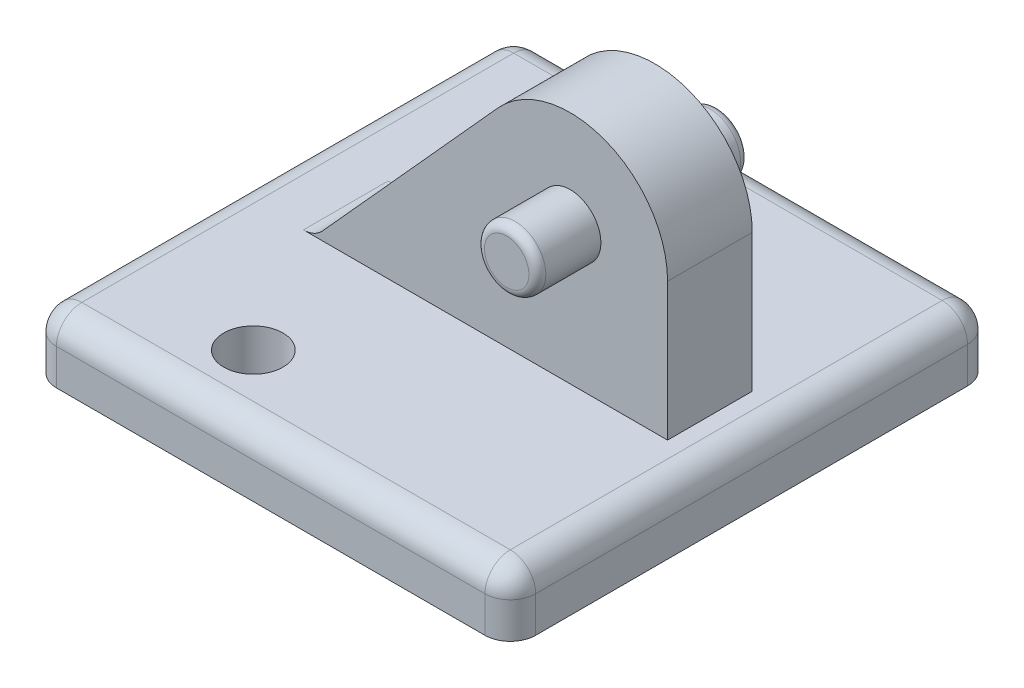
ISO-10303-21;
HEADER;
FILE_DESCRIPTION(('STEP AP214'),'2;1');
FILE_NAME('part.step','',(''),(''),'','','');
FILE_SCHEMA(('AUTOMOTIVE_DESIGN { 1 0 10303 214 1 1 1 1 }'));
ENDSEC;
DATA;
#1=APPLICATION_CONTEXT('core data for automotive mechanical design processes');
#2=APPLICATION_PROTOCOL_DEFINITION('international standard','automotive_design',2000,#1);
#3=PRODUCT_CONTEXT('',#1,'mechanical');
#4=PRODUCT('Part','Part','',(#3));
#5=PRODUCT_RELATED_PRODUCT_CATEGORY('part','',(#4));
#6=PRODUCT_DEFINITION_FORMATION('','',#4);
#7=PRODUCT_DEFINITION_CONTEXT('part definition',#1,'design');
#8=PRODUCT_DEFINITION('design','',#6,#7);
#9=PRODUCT_DEFINITION_SHAPE('','',#8);
#10=(LENGTH_UNIT() NAMED_UNIT(*) SI_UNIT(.MILLI.,.METRE.));
#11=(NAMED_UNIT(*) PLANE_ANGLE_UNIT() SI_UNIT($,.RADIAN.));
#12=(NAMED_UNIT(*) SI_UNIT($,.STERADIAN.) SOLID_ANGLE_UNIT());
#13=UNCERTAINTY_MEASURE_WITH_UNIT(LENGTH_MEASURE(1.E-05),#10,'distance_accuracy_value','');
#14=(GEOMETRIC_REPRESENTATION_CONTEXT(3) GLOBAL_UNCERTAINTY_ASSIGNED_CONTEXT((#13)) GLOBAL_UNIT_ASSIGNED_CONTEXT((#10,
#11,#12)) REPRESENTATION_CONTEXT('',''));
#15=CARTESIAN_POINT('',(0.,0.,0.));
#16=DIRECTION('',(0.,0.,1.));
#17=DIRECTION('',(1.,0.,0.));
#18=AXIS2_PLACEMENT_3D('',#15,#16,#17);
#19=CARTESIAN_POINT('',(0.,1.8415,0.));
#20=DIRECTION('',(0.,1.,0.));
#21=DIRECTION('',(0.,0.,1.));
#22=AXIS2_PLACEMENT_3D('',#19,#20,#21);
#23=PLANE('',#22);
#24=DIRECTION('',(1.,0.,0.));
#25=VECTOR('',#24,1.);
#26=CARTESIAN_POINT('',(7.1882,1.8415,6.477));
#27=LINE('',#26,#25);
#28=CARTESIAN_POINT('',(-6.4262,1.8415,6.477));
#29=VERTEX_POINT('',#28);
#30=CARTESIAN_POINT('',(6.4262,1.8415,6.477));
#31=VERTEX_POINT('',#30);
#32=EDGE_CURVE('E243',#29,#31,#27,.T.);
#33=ORIENTED_EDGE('',*,*,#32,.T.);
#34=DIRECTION('',(0.,0.,-1.));
#35=VECTOR('',#34,1.);
#36=CARTESIAN_POINT('',(6.4262,1.8415,-7.239));
#37=LINE('',#36,#35);
#38=CARTESIAN_POINT('',(6.4262,1.8415,-6.477));
#39=VERTEX_POINT('',#38);
#40=EDGE_CURVE('E249',#31,#39,#37,.T.);
#41=ORIENTED_EDGE('',*,*,#40,.T.);
#42=DIRECTION('',(-1.,0.,0.));
#43=VECTOR('',#42,1.);
#44=CARTESIAN_POINT('',(-7.1882,1.8415,-6.477));
#45=LINE('',#44,#43);
#46=CARTESIAN_POINT('',(-6.4262,1.8415,-6.477));
#47=VERTEX_POINT('',#46);
#48=EDGE_CURVE('E246',#39,#47,#45,.T.);
#49=ORIENTED_EDGE('',*,*,#48,.T.);
#50=DIRECTION('',(0.,0.,1.));
#51=VECTOR('',#50,1.);
#52=CARTESIAN_POINT('',(-6.4262,1.8415,7.239));
#53=LINE('',#52,#51);
#54=EDGE_CURVE('E240',#47,#29,#53,.T.);
#55=ORIENTED_EDGE('',*,*,#54,.T.);
#56=EDGE_LOOP('',(#33,#41,#49,#55));
#57=FACE_BOUND('',#56,.T.);
#58=DIRECTION('',(0.,0.,-1.));
#59=VECTOR('',#58,1.);
#60=CARTESIAN_POINT('',(-4.98675839684199,1.8415,-1.27));
#61=LINE('',#60,#59);
#62=CARTESIAN_POINT('',(-4.98675839684199,1.8415,1.27));
#63=VERTEX_POINT('',#62);
#64=CARTESIAN_POINT('',(-4.98675839684199,1.8415,-1.27));
#65=VERTEX_POINT('',#64);
#66=EDGE_CURVE('E236',#63,#65,#61,.T.);
#67=ORIENTED_EDGE('',*,*,#66,.T.);
#68=DIRECTION('',(1.,0.,0.));
#69=VECTOR('',#68,1.);
#70=CARTESIAN_POINT('',(0.,1.8415,-1.27));
#71=LINE('',#70,#69);
#72=CARTESIAN_POINT('',(5.93687294963796,1.8415,-1.27));
#73=VERTEX_POINT('',#72);
#74=EDGE_CURVE('E178',#65,#73,#71,.T.);
#75=ORIENTED_EDGE('',*,*,#74,.T.);
#76=DIRECTION('',(0.,0.,-1.));
#77=VECTOR('',#76,1.);
#78=CARTESIAN_POINT('',(5.93687294963796,1.8415,1.27));
#79=LINE('',#78,#77);
#80=CARTESIAN_POINT('',(5.93687294963796,1.8415,1.27));
#81=VERTEX_POINT('',#80);
#82=EDGE_CURVE('E168',#81,#73,#79,.T.);
#83=ORIENTED_EDGE('',*,*,#82,.F.);
#84=DIRECTION('',(1.,0.,0.));
#85=VECTOR('',#84,1.);
#86=CARTESIAN_POINT('',(0.,1.8415,1.27));
#87=LINE('',#86,#85);
#88=EDGE_CURVE('E157',#63,#81,#87,.T.);
#89=ORIENTED_EDGE('',*,*,#88,.F.);
#90=EDGE_LOOP('',(#67,#75,#83,#89));
#91=FACE_BOUND('',#90,.T.);
#92=CARTESIAN_POINT('',(-2.6162,1.8415,-5.1435));
#93=DIRECTION('',(0.,1.,0.));
#94=DIRECTION('',(0.,0.,1.));
#95=AXIS2_PLACEMENT_3D('',#92,#93,#94);
#96=CIRCLE('',#95,0.889);
#97=CARTESIAN_POINT('',(-2.6162,1.8415,-4.2545));
#98=VERTEX_POINT('',#97);
#99=EDGE_CURVE('E213',#98,#98,#96,.T.);
#100=ORIENTED_EDGE('',*,*,#99,.F.);
#101=EDGE_LOOP('',(#100));
#102=FACE_BOUND('',#101,.T.);
#103=CARTESIAN_POINT('',(-2.6162,1.8415,5.1435));
#104=DIRECTION('',(0.,1.,0.));
#105=DIRECTION('',(0.,0.,1.));
#106=AXIS2_PLACEMENT_3D('',#103,#104,#105);
#107=CIRCLE('',#106,0.889);
#108=CARTESIAN_POINT('',(-2.6162,1.8415,6.0325));
#109=VERTEX_POINT('',#108);
#110=EDGE_CURVE('E205',#109,#109,#107,.T.);
#111=ORIENTED_EDGE('',*,*,#110,.F.);
#112=EDGE_LOOP('',(#111));
#113=FACE_BOUND('',#112,.T.);
#114=ADVANCED_FACE('F41',(#57,#91,#102,#113),#23,.T.);
#115=CARTESIAN_POINT('',(0.,0.,0.));
#116=DIRECTION('',(0.,1.,0.));
#117=DIRECTION('',(0.,0.,1.));
#118=AXIS2_PLACEMENT_3D('',#115,#116,#117);
#119=PLANE('',#118);
#120=DIRECTION('',(-1.,0.,0.));
#121=VECTOR('',#120,1.);
#122=CARTESIAN_POINT('',(-7.1882,0.,-7.239));
#123=LINE('',#122,#121);
#124=CARTESIAN_POINT('',(6.4262,0.,-7.239));
#125=VERTEX_POINT('',#124);
#126=CARTESIAN_POINT('',(-6.4262,0.,-7.239));
#127=VERTEX_POINT('',#126);
#128=EDGE_CURVE('E232',#125,#127,#123,.T.);
#129=ORIENTED_EDGE('',*,*,#128,.F.);
#130=CARTESIAN_POINT('',(6.4262,0.,-6.477));
#131=DIRECTION('',(0.,1.,0.));
#132=DIRECTION('',(0.,0.,1.));
#133=AXIS2_PLACEMENT_3D('',#130,#131,#132);
#134=CIRCLE('',#133,0.762);
#135=CARTESIAN_POINT('',(7.1882,0.,-6.477));
#136=VERTEX_POINT('',#135);
#137=EDGE_CURVE('E299',#125,#136,#134,.F.);
#138=ORIENTED_EDGE('',*,*,#137,.T.);
#139=DIRECTION('',(0.,0.,-1.));
#140=VECTOR('',#139,1.);
#141=CARTESIAN_POINT('',(7.1882,0.,-7.239));
#142=LINE('',#141,#140);
#143=CARTESIAN_POINT('',(7.1882,0.,6.477));
#144=VERTEX_POINT('',#143);
#145=EDGE_CURVE('E228',#144,#136,#142,.T.);
#146=ORIENTED_EDGE('',*,*,#145,.F.);
#147=CARTESIAN_POINT('',(6.4262,0.,6.477));
#148=DIRECTION('',(0.,1.,0.));
#149=DIRECTION('',(0.,0.,1.));
#150=AXIS2_PLACEMENT_3D('',#147,#148,#149);
#151=CIRCLE('',#150,0.762);
#152=CARTESIAN_POINT('',(6.4262,0.,7.239));
#153=VERTEX_POINT('',#152);
#154=EDGE_CURVE('E293',#144,#153,#151,.F.);
#155=ORIENTED_EDGE('',*,*,#154,.T.);
#156=DIRECTION('',(1.,0.,0.));
#157=VECTOR('',#156,1.);
#158=CARTESIAN_POINT('',(-7.1882,0.,7.239));
#159=LINE('',#158,#157);
#160=CARTESIAN_POINT('',(-6.4262,0.,7.239));
#161=VERTEX_POINT('',#160);
#162=EDGE_CURVE('E224',#161,#153,#159,.T.);
#163=ORIENTED_EDGE('',*,*,#162,.F.);
#164=CARTESIAN_POINT('',(-6.4262,0.,6.477));
#165=DIRECTION('',(0.,1.,0.));
#166=DIRECTION('',(0.,0.,1.));
#167=AXIS2_PLACEMENT_3D('',#164,#165,#166);
#168=CIRCLE('',#167,0.762);
#169=CARTESIAN_POINT('',(-7.1882,0.,6.477));
#170=VERTEX_POINT('',#169);
#171=EDGE_CURVE('E290',#161,#170,#168,.F.);
#172=ORIENTED_EDGE('',*,*,#171,.T.);
#173=DIRECTION('',(0.,0.,1.));
#174=VECTOR('',#173,1.);
#175=CARTESIAN_POINT('',(-7.1882,0.,-7.239));
#176=LINE('',#175,#174);
#177=CARTESIAN_POINT('',(-7.1882,0.,-6.477));
#178=VERTEX_POINT('',#177);
#179=EDGE_CURVE('E217',#178,#170,#176,.T.);
#180=ORIENTED_EDGE('',*,*,#179,.F.);
#181=CARTESIAN_POINT('',(-6.4262,0.,-6.477));
#182=DIRECTION('',(0.,1.,0.));
#183=DIRECTION('',(0.,0.,1.));
#184=AXIS2_PLACEMENT_3D('',#181,#182,#183);
#185=CIRCLE('',#184,0.762);
#186=EDGE_CURVE('E296',#178,#127,#185,.F.);
#187=ORIENTED_EDGE('',*,*,#186,.T.);
#188=EDGE_LOOP('',(#129,#138,#146,#155,#163,#172,#180,#187));
#189=FACE_BOUND('',#188,.T.);
#190=CARTESIAN_POINT('',(-2.6162,0.,-5.1435));
#191=DIRECTION('',(0.,1.,0.));
#192=DIRECTION('',(0.,0.,1.));
#193=AXIS2_PLACEMENT_3D('',#190,#191,#192);
#194=CIRCLE('',#193,0.889);
#195=CARTESIAN_POINT('',(-2.6162,0.,-4.2545));
#196=VERTEX_POINT('',#195);
#197=EDGE_CURVE('E209',#196,#196,#194,.T.);
#198=ORIENTED_EDGE('',*,*,#197,.T.);
#199=EDGE_LOOP('',(#198));
#200=FACE_BOUND('',#199,.T.);
#201=CARTESIAN_POINT('',(-2.6162,0.,5.1435));
#202=DIRECTION('',(0.,1.,0.));
#203=DIRECTION('',(0.,0.,1.));
#204=AXIS2_PLACEMENT_3D('',#201,#202,#203);
#205=CIRCLE('',#204,0.889);
#206=CARTESIAN_POINT('',(-2.6162,0.,6.0325));
#207=VERTEX_POINT('',#206);
#208=EDGE_CURVE('E167',#207,#207,#205,.T.);
#209=ORIENTED_EDGE('',*,*,#208,.T.);
#210=EDGE_LOOP('',(#209));
#211=FACE_BOUND('',#210,.T.);
#212=ADVANCED_FACE('F378',(#189,#200,#211),#119,.F.);
#213=CARTESIAN_POINT('',(-7.1882,1.8415,-7.239));
#214=DIRECTION('',(1.,0.,0.));
#215=DIRECTION('',(0.,0.,-1.));
#216=AXIS2_PLACEMENT_3D('',#213,#214,#215);
#217=PLANE('',#216);
#218=DIRECTION('',(0.,0.,1.));
#219=VECTOR('',#218,1.);
#220=CARTESIAN_POINT('',(-7.1882,1.0795,-7.239));
#221=LINE('',#220,#219);
#222=CARTESIAN_POINT('',(-7.1882,1.0795,6.477));
#223=VERTEX_POINT('',#222);
#224=CARTESIAN_POINT('',(-7.1882,1.0795,-6.477));
#225=VERTEX_POINT('',#224);
#226=EDGE_CURVE('E284',#223,#225,#221,.F.);
#227=ORIENTED_EDGE('',*,*,#226,.T.);
#228=DIRECTION('',(0.,-1.,0.));
#229=VECTOR('',#228,1.);
#230=CARTESIAN_POINT('',(-7.1882,1.8415,-6.477));
#231=LINE('',#230,#229);
#232=EDGE_CURVE('E287',#225,#178,#231,.T.);
#233=ORIENTED_EDGE('',*,*,#232,.T.);
#234=ORIENTED_EDGE('',*,*,#179,.T.);
#235=DIRECTION('',(0.,-1.,0.));
#236=VECTOR('',#235,1.);
#237=CARTESIAN_POINT('',(-7.1882,1.8415,6.477));
#238=LINE('',#237,#236);
#239=EDGE_CURVE('E281',#170,#223,#238,.F.);
#240=ORIENTED_EDGE('',*,*,#239,.T.);
#241=EDGE_LOOP('',(#227,#233,#234,#240));
#242=FACE_BOUND('',#241,.T.);
#243=ADVANCED_FACE('F384',(#242),#217,.F.);
#244=CARTESIAN_POINT('',(-7.1882,1.8415,7.239));
#245=DIRECTION('',(0.,0.,-1.));
#246=DIRECTION('',(-1.,0.,0.));
#247=AXIS2_PLACEMENT_3D('',#244,#245,#246);
#248=PLANE('',#247);
#249=ORIENTED_EDGE('',*,*,#162,.T.);
#250=DIRECTION('',(0.,-1.,0.));
#251=VECTOR('',#250,1.);
#252=CARTESIAN_POINT('',(6.4262,1.8415,7.239));
#253=LINE('',#252,#251);
#254=CARTESIAN_POINT('',(6.4262,1.0795,7.239));
#255=VERTEX_POINT('',#254);
#256=EDGE_CURVE('E278',#153,#255,#253,.F.);
#257=ORIENTED_EDGE('',*,*,#256,.T.);
#258=DIRECTION('',(1.,0.,0.));
#259=VECTOR('',#258,1.);
#260=CARTESIAN_POINT('',(-7.1882,1.0795,7.239));
#261=LINE('',#260,#259);
#262=CARTESIAN_POINT('',(-6.4262,1.0795,7.239));
#263=VERTEX_POINT('',#262);
#264=EDGE_CURVE('E275',#255,#263,#261,.F.);
#265=ORIENTED_EDGE('',*,*,#264,.T.);
#266=DIRECTION('',(0.,-1.,0.));
#267=VECTOR('',#266,1.);
#268=CARTESIAN_POINT('',(-6.4262,1.8415,7.239));
#269=LINE('',#268,#267);
#270=EDGE_CURVE('E272',#263,#161,#269,.T.);
#271=ORIENTED_EDGE('',*,*,#270,.T.);
#272=EDGE_LOOP('',(#249,#257,#265,#271));
#273=FACE_BOUND('',#272,.T.);
#274=ADVANCED_FACE('F399',(#273),#248,.F.);
#275=CARTESIAN_POINT('',(7.1882,1.8415,-7.239));
#276=DIRECTION('',(-1.,0.,0.));
#277=DIRECTION('',(0.,0.,1.));
#278=AXIS2_PLACEMENT_3D('',#275,#276,#277);
#279=PLANE('',#278);
#280=ORIENTED_EDGE('',*,*,#145,.T.);
#281=DIRECTION('',(0.,-1.,0.));
#282=VECTOR('',#281,1.);
#283=CARTESIAN_POINT('',(7.1882,1.8415,-6.477));
#284=LINE('',#283,#282);
#285=CARTESIAN_POINT('',(7.1882,1.0795,-6.477));
#286=VERTEX_POINT('',#285);
#287=EDGE_CURVE('E260',#136,#286,#284,.F.);
#288=ORIENTED_EDGE('',*,*,#287,.T.);
#289=DIRECTION('',(0.,0.,-1.));
#290=VECTOR('',#289,1.);
#291=CARTESIAN_POINT('',(7.1882,1.0795,7.239));
#292=LINE('',#291,#290);
#293=CARTESIAN_POINT('',(7.1882,1.0795,6.477));
#294=VERTEX_POINT('',#293);
#295=EDGE_CURVE('E256',#286,#294,#292,.F.);
#296=ORIENTED_EDGE('',*,*,#295,.T.);
#297=DIRECTION('',(0.,-1.,0.));
#298=VECTOR('',#297,1.);
#299=CARTESIAN_POINT('',(7.1882,1.8415,6.477));
#300=LINE('',#299,#298);
#301=EDGE_CURVE('E253',#294,#144,#300,.T.);
#302=ORIENTED_EDGE('',*,*,#301,.T.);
#303=EDGE_LOOP('',(#280,#288,#296,#302));
#304=FACE_BOUND('',#303,.T.);
#305=ADVANCED_FACE('F395',(#304),#279,.F.);
#306=CARTESIAN_POINT('',(-7.1882,1.8415,-7.239));
#307=DIRECTION('',(0.,0.,1.));
#308=DIRECTION('',(1.,0.,0.));
#309=AXIS2_PLACEMENT_3D('',#306,#307,#308);
#310=PLANE('',#309);
#311=DIRECTION('',(-1.,0.,0.));
#312=VECTOR('',#311,1.);
#313=CARTESIAN_POINT('',(7.1882,1.0795,-7.239));
#314=LINE('',#313,#312);
#315=CARTESIAN_POINT('',(-6.4262,1.0795,-7.239));
#316=VERTEX_POINT('',#315);
#317=CARTESIAN_POINT('',(6.4262,1.0795,-7.239));
#318=VERTEX_POINT('',#317);
#319=EDGE_CURVE('E266',#316,#318,#314,.F.);
#320=ORIENTED_EDGE('',*,*,#319,.T.);
#321=DIRECTION('',(0.,-1.,0.));
#322=VECTOR('',#321,1.);
#323=CARTESIAN_POINT('',(6.4262,1.8415,-7.239));
#324=LINE('',#323,#322);
#325=EDGE_CURVE('E269',#318,#125,#324,.T.);
#326=ORIENTED_EDGE('',*,*,#325,.T.);
#327=ORIENTED_EDGE('',*,*,#128,.T.);
#328=DIRECTION('',(0.,-1.,0.));
#329=VECTOR('',#328,1.);
#330=CARTESIAN_POINT('',(-6.4262,1.8415,-7.239));
#331=LINE('',#330,#329);
#332=EDGE_CURVE('E263',#127,#316,#331,.F.);
#333=ORIENTED_EDGE('',*,*,#332,.T.);
#334=EDGE_LOOP('',(#320,#326,#327,#333));
#335=FACE_BOUND('',#334,.T.);
#336=ADVANCED_FACE('F392',(#335),#310,.F.);
#337=CARTESIAN_POINT('',(-2.6162,1.8415,-5.1435));
#338=DIRECTION('',(0.,-1.,0.));
#339=DIRECTION('',(0.,0.,-1.));
#340=AXIS2_PLACEMENT_3D('',#337,#338,#339);
#341=CYLINDRICAL_SURFACE('',#340,0.889);
#342=ORIENTED_EDGE('',*,*,#99,.T.);
#343=EDGE_LOOP('',(#342));
#344=FACE_BOUND('',#343,.T.);
#345=ORIENTED_EDGE('',*,*,#197,.F.);
#346=EDGE_LOOP('',(#345));
#347=FACE_BOUND('',#346,.T.);
#348=ADVANCED_FACE('F389',(#344,#347),#341,.F.);
#349=CARTESIAN_POINT('',(-2.6162,1.8415,5.1435));
#350=DIRECTION('',(0.,-1.,0.));
#351=DIRECTION('',(0.,0.,-1.));
#352=AXIS2_PLACEMENT_3D('',#349,#350,#351);
#353=CYLINDRICAL_SURFACE('',#352,0.889);
#354=ORIENTED_EDGE('',*,*,#110,.T.);
#355=EDGE_LOOP('',(#354));
#356=FACE_BOUND('',#355,.T.);
#357=ORIENTED_EDGE('',*,*,#208,.F.);
#358=EDGE_LOOP('',(#357));
#359=FACE_BOUND('',#358,.T.);
#360=ADVANCED_FACE('F495',(#356,#359),#353,.F.);
#361=CARTESIAN_POINT('',(3.01587294963796,5.969,1.27));
#362=DIRECTION('',(0.,0.,-1.));
#363=DIRECTION('',(-1.,0.,0.));
#364=AXIS2_PLACEMENT_3D('',#361,#362,#363);
#365=CYLINDRICAL_SURFACE('',#364,2.921);
#366=CARTESIAN_POINT('',(3.01587294963796,5.969,-1.27));
#367=DIRECTION('',(0.,0.,1.));
#368=DIRECTION('',(1.,0.,0.));
#369=AXIS2_PLACEMENT_3D('',#366,#367,#368);
#370=CIRCLE('',#369,2.921);
#371=CARTESIAN_POINT('',(0.848172568760246,7.9268856092077,-1.27));
#372=VERTEX_POINT('',#371);
#373=CARTESIAN_POINT('',(5.93687294963796,5.969,-1.27));
#374=VERTEX_POINT('',#373);
#375=EDGE_CURVE('E165',#372,#374,#370,.F.);
#376=ORIENTED_EDGE('',*,*,#375,.F.);
#377=DIRECTION('',(0.,0.,-1.));
#378=VECTOR('',#377,1.);
#379=CARTESIAN_POINT('',(0.848172568760246,7.9268856092077,1.27));
#380=LINE('',#379,#378);
#381=CARTESIAN_POINT('',(0.848172568760246,7.9268856092077,1.27));
#382=VERTEX_POINT('',#381);
#383=EDGE_CURVE('E150',#382,#372,#380,.T.);
#384=ORIENTED_EDGE('',*,*,#383,.F.);
#385=CARTESIAN_POINT('',(3.01587294963796,5.969,1.27));
#386=DIRECTION('',(0.,0.,1.));
#387=DIRECTION('',(1.,0.,0.));
#388=AXIS2_PLACEMENT_3D('',#385,#386,#387);
#389=CIRCLE('',#388,2.921);
#390=CARTESIAN_POINT('',(5.93687294963796,5.969,1.27));
#391=VERTEX_POINT('',#390);
#392=EDGE_CURVE('E158',#382,#391,#389,.F.);
#393=ORIENTED_EDGE('',*,*,#392,.T.);
#394=DIRECTION('',(0.,0.,-1.));
#395=VECTOR('',#394,1.);
#396=CARTESIAN_POINT('',(5.93687294963796,5.969,1.27));
#397=LINE('',#396,#395);
#398=EDGE_CURVE('E191',#391,#374,#397,.T.);
#399=ORIENTED_EDGE('',*,*,#398,.T.);
#400=EDGE_LOOP('',(#376,#384,#393,#399));
#401=FACE_BOUND('',#400,.T.);
#402=ADVANCED_FACE('F162',(#401),#365,.T.);
#403=CARTESIAN_POINT('',(-3.47588287024308,3.13944727369792,1.27));
#404=DIRECTION('',(-0.742108997219347,0.670279222597638,0.));
#405=DIRECTION('',(-0.670279222597639,-0.742108997219348,0.));
#406=AXIS2_PLACEMENT_3D('',#403,#404,#405);
#407=PLANE('',#406);
#408=DIRECTION('',(0.670279222597639,0.742108997219348,0.));
#409=VECTOR('',#408,1.);
#410=CARTESIAN_POINT('',(-3.47588287024308,3.13944727369792,-1.27));
#411=LINE('',#410,#409);
#412=CARTESIAN_POINT('',(-4.42127134096085,2.0927472323806,-1.27));
#413=VERTEX_POINT('',#412);
#414=EDGE_CURVE('E194',#413,#372,#411,.T.);
#415=ORIENTED_EDGE('',*,*,#414,.F.);
#416=DIRECTION('',(0.,0.,-1.));
#417=VECTOR('',#416,1.);
#418=CARTESIAN_POINT('',(-4.42127134096085,2.0927472323806,1.27));
#419=LINE('',#418,#417);
#420=CARTESIAN_POINT('',(-4.42127134096085,2.0927472323806,1.27));
#421=VERTEX_POINT('',#420);
#422=EDGE_CURVE('E57',#413,#421,#419,.F.);
#423=ORIENTED_EDGE('',*,*,#422,.T.);
#424=DIRECTION('',(0.670279222597639,0.742108997219348,0.));
#425=VECTOR('',#424,1.);
#426=CARTESIAN_POINT('',(-3.47588287024308,3.13944727369792,1.27));
#427=LINE('',#426,#425);
#428=EDGE_CURVE('E147',#421,#382,#427,.T.);
#429=ORIENTED_EDGE('',*,*,#428,.T.);
#430=ORIENTED_EDGE('',*,*,#383,.T.);
#431=EDGE_LOOP('',(#415,#423,#429,#430));
#432=FACE_BOUND('',#431,.T.);
#433=ADVANCED_FACE('F149',(#432),#407,.T.);
#434=CARTESIAN_POINT('',(5.93687294963796,0.,1.27));
#435=DIRECTION('',(1.,0.,0.));
#436=DIRECTION('',(0.,1.,0.));
#437=AXIS2_PLACEMENT_3D('',#434,#435,#436);
#438=PLANE('',#437);
#439=DIRECTION('',(0.,-1.,0.));
#440=VECTOR('',#439,1.);
#441=CARTESIAN_POINT('',(5.93687294963796,0.,-1.27));
#442=LINE('',#441,#440);
#443=EDGE_CURVE('E175',#374,#73,#442,.T.);
#444=ORIENTED_EDGE('',*,*,#443,.F.);
#445=ORIENTED_EDGE('',*,*,#398,.F.);
#446=DIRECTION('',(0.,-1.,0.));
#447=VECTOR('',#446,1.);
#448=CARTESIAN_POINT('',(5.93687294963796,0.,1.27));
#449=LINE('',#448,#447);
#450=EDGE_CURVE('E173',#391,#81,#449,.T.);
#451=ORIENTED_EDGE('',*,*,#450,.T.);
#452=ORIENTED_EDGE('',*,*,#82,.T.);
#453=EDGE_LOOP('',(#444,#445,#451,#452));
#454=FACE_BOUND('',#453,.T.);
#455=ADVANCED_FACE('F463',(#454),#438,.T.);
#456=CARTESIAN_POINT('',(0.,0.,1.27));
#457=DIRECTION('',(0.,0.,1.));
#458=DIRECTION('',(1.,0.,0.));
#459=AXIS2_PLACEMENT_3D('',#456,#457,#458);
#460=PLANE('',#459);
#461=ORIENTED_EDGE('',*,*,#392,.F.);
#462=ORIENTED_EDGE('',*,*,#428,.F.);
#463=CARTESIAN_POINT('',(-4.98675839684199,2.6035,1.27));
#464=DIRECTION('',(0.,0.,1.));
#465=DIRECTION('',(1.,0.,0.));
#466=AXIS2_PLACEMENT_3D('',#463,#464,#465);
#467=CIRCLE('',#466,0.762);
#468=EDGE_CURVE('E306',#421,#63,#467,.F.);
#469=ORIENTED_EDGE('',*,*,#468,.T.);
#470=ORIENTED_EDGE('',*,*,#88,.T.);
#471=ORIENTED_EDGE('',*,*,#450,.F.);
#472=EDGE_LOOP('',(#461,#462,#469,#470,#471));
#473=FACE_BOUND('',#472,.T.);
#474=CARTESIAN_POINT('',(3.01587294963796,5.969,1.27));
#475=DIRECTION('',(0.,0.,1.));
#476=DIRECTION('',(1.,0.,0.));
#477=AXIS2_PLACEMENT_3D('',#474,#475,#476);
#478=CIRCLE('',#477,0.92075);
#479=CARTESIAN_POINT('',(3.93662294963796,5.969,1.27));
#480=VERTEX_POINT('',#479);
#481=EDGE_CURVE('E187',#480,#480,#478,.T.);
#482=ORIENTED_EDGE('',*,*,#481,.F.);
#483=EDGE_LOOP('',(#482));
#484=FACE_BOUND('',#483,.T.);
#485=ADVANCED_FACE('F170',(#473,#484),#460,.T.);
#486=CARTESIAN_POINT('',(0.,0.,-1.27));
#487=DIRECTION('',(0.,0.,1.));
#488=DIRECTION('',(1.,0.,0.));
#489=AXIS2_PLACEMENT_3D('',#486,#487,#488);
#490=PLANE('',#489);
#491=ORIENTED_EDGE('',*,*,#375,.T.);
#492=ORIENTED_EDGE('',*,*,#443,.T.);
#493=ORIENTED_EDGE('',*,*,#74,.F.);
#494=CARTESIAN_POINT('',(-4.98675839684199,2.6035,-1.27));
#495=DIRECTION('',(0.,0.,1.));
#496=DIRECTION('',(1.,0.,0.));
#497=AXIS2_PLACEMENT_3D('',#494,#495,#496);
#498=CIRCLE('',#497,0.762);
#499=EDGE_CURVE('E65',#65,#413,#498,.T.);
#500=ORIENTED_EDGE('',*,*,#499,.T.);
#501=ORIENTED_EDGE('',*,*,#414,.T.);
#502=EDGE_LOOP('',(#491,#492,#493,#500,#501));
#503=FACE_BOUND('',#502,.T.);
#504=CARTESIAN_POINT('',(3.01587294963796,5.969,-1.27));
#505=DIRECTION('',(0.,0.,1.));
#506=DIRECTION('',(1.,0.,0.));
#507=AXIS2_PLACEMENT_3D('',#504,#505,#506);
#508=CIRCLE('',#507,0.92075);
#509=CARTESIAN_POINT('',(3.93662294963796,5.969,-1.27));
#510=VERTEX_POINT('',#509);
#511=EDGE_CURVE('E181',#510,#510,#508,.F.);
#512=ORIENTED_EDGE('',*,*,#511,.F.);
#513=EDGE_LOOP('',(#512));
#514=FACE_BOUND('',#513,.T.);
#515=ADVANCED_FACE('F465',(#503,#514),#490,.F.);
#516=CARTESIAN_POINT('',(0.,0.,-3.175));
#517=DIRECTION('',(0.,0.,1.));
#518=DIRECTION('',(1.,0.,0.));
#519=AXIS2_PLACEMENT_3D('',#516,#517,#518);
#520=PLANE('',#519);
#521=CARTESIAN_POINT('',(3.01587294963796,5.969,-3.175));
#522=DIRECTION('',(0.,0.,1.));
#523=DIRECTION('',(1.,0.,0.));
#524=AXIS2_PLACEMENT_3D('',#521,#522,#523);
#525=CIRCLE('',#524,0.66675);
#526=CARTESIAN_POINT('',(3.68262294963796,5.969,-3.175));
#527=VERTEX_POINT('',#526);
#528=EDGE_CURVE('E359',#527,#527,#525,.F.);
#529=ORIENTED_EDGE('',*,*,#528,.T.);
#530=EDGE_LOOP('',(#529));
#531=FACE_BOUND('',#530,.T.);
#532=ADVANCED_FACE('F468',(#531),#520,.F.);
#533=CARTESIAN_POINT('',(3.01587294963796,5.969,3.175));
#534=DIRECTION('',(0.,0.,-1.));
#535=DIRECTION('',(-1.,0.,0.));
#536=AXIS2_PLACEMENT_3D('',#533,#534,#535);
#537=CYLINDRICAL_SURFACE('',#536,0.92075);
#538=CARTESIAN_POINT('',(3.01587294963796,5.969,-2.921));
#539=DIRECTION('',(0.,0.,1.));
#540=DIRECTION('',(1.,0.,0.));
#541=AXIS2_PLACEMENT_3D('',#538,#539,#540);
#542=CIRCLE('',#541,0.92075);
#543=CARTESIAN_POINT('',(3.93662294963796,5.969,-2.921));
#544=VERTEX_POINT('',#543);
#545=EDGE_CURVE('E309',#544,#544,#542,.T.);
#546=ORIENTED_EDGE('',*,*,#545,.T.);
#547=EDGE_LOOP('',(#546));
#548=FACE_BOUND('',#547,.T.);
#549=ORIENTED_EDGE('',*,*,#511,.T.);
#550=EDGE_LOOP('',(#549));
#551=FACE_BOUND('',#550,.T.);
#552=ADVANCED_FACE('F474',(#548,#551),#537,.T.);
#553=CARTESIAN_POINT('',(3.01587294963796,5.969,2.921));
#554=DIRECTION('',(0.,0.,1.));
#555=DIRECTION('',(1.,0.,0.));
#556=AXIS2_PLACEMENT_3D('',#553,#554,#555);
#557=CIRCLE('',#556,0.92075);
#558=CARTESIAN_POINT('',(3.93662294963796,5.969,2.921));
#559=VERTEX_POINT('',#558);
#560=EDGE_CURVE('E11',#559,#559,#557,.F.);
#561=ORIENTED_EDGE('',*,*,#560,.T.);
#562=EDGE_LOOP('',(#561));
#563=FACE_BOUND('',#562,.T.);
#564=ORIENTED_EDGE('',*,*,#481,.T.);
#565=EDGE_LOOP('',(#564));
#566=FACE_BOUND('',#565,.T.);
#567=ADVANCED_FACE('F476',(#563,#566),#537,.T.);
#568=CARTESIAN_POINT('',(0.,0.,3.175));
#569=DIRECTION('',(0.,0.,1.));
#570=DIRECTION('',(1.,0.,0.));
#571=AXIS2_PLACEMENT_3D('',#568,#569,#570);
#572=PLANE('',#571);
#573=CARTESIAN_POINT('',(3.01587294963796,5.969,3.175));
#574=DIRECTION('',(0.,0.,1.));
#575=DIRECTION('',(1.,0.,0.));
#576=AXIS2_PLACEMENT_3D('',#573,#574,#575);
#577=CIRCLE('',#576,0.66675);
#578=CARTESIAN_POINT('',(3.68262294963796,5.969,3.175));
#579=VERTEX_POINT('',#578);
#580=EDGE_CURVE('E50',#579,#579,#577,.T.);
#581=ORIENTED_EDGE('',*,*,#580,.T.);
#582=EDGE_LOOP('',(#581));
#583=FACE_BOUND('',#582,.T.);
#584=ADVANCED_FACE('F366',(#583),#572,.T.);
#585=CARTESIAN_POINT('',(-6.4262,1.8415,6.477));
#586=DIRECTION('',(0.,-1.,0.));
#587=DIRECTION('',(0.,0.,-1.));
#588=AXIS2_PLACEMENT_3D('',#585,#586,#587);
#589=CYLINDRICAL_SURFACE('',#588,0.762);
#590=ORIENTED_EDGE('',*,*,#171,.F.);
#591=ORIENTED_EDGE('',*,*,#270,.F.);
#592=CARTESIAN_POINT('',(-6.4262,1.0795,6.477));
#593=DIRECTION('',(0.,1.,0.));
#594=DIRECTION('',(0.,0.,1.));
#595=AXIS2_PLACEMENT_3D('',#592,#593,#594);
#596=CIRCLE('',#595,0.762);
#597=EDGE_CURVE('E352',#223,#263,#596,.T.);
#598=ORIENTED_EDGE('',*,*,#597,.F.);
#599=ORIENTED_EDGE('',*,*,#239,.F.);
#600=EDGE_LOOP('',(#590,#591,#598,#599));
#601=FACE_BOUND('',#600,.T.);
#602=ADVANCED_FACE('F450',(#601),#589,.T.);
#603=CARTESIAN_POINT('',(-6.4262,1.0795,0.));
#604=DIRECTION('',(0.,0.,-1.));
#605=DIRECTION('',(-1.,0.,0.));
#606=AXIS2_PLACEMENT_3D('',#603,#604,#605);
#607=CYLINDRICAL_SURFACE('',#606,0.762);
#608=CARTESIAN_POINT('',(-6.4262,1.0795,-6.477));
#609=DIRECTION('',(0.,0.,-1.));
#610=DIRECTION('',(-1.,0.,0.));
#611=AXIS2_PLACEMENT_3D('',#608,#609,#610);
#612=CIRCLE('',#611,0.762);
#613=EDGE_CURVE('E344',#225,#47,#612,.T.);
#614=ORIENTED_EDGE('',*,*,#613,.F.);
#615=ORIENTED_EDGE('',*,*,#226,.F.);
#616=CARTESIAN_POINT('',(-6.4262,1.0795,6.477));
#617=DIRECTION('',(0.,0.,1.));
#618=DIRECTION('',(1.,0.,0.));
#619=AXIS2_PLACEMENT_3D('',#616,#617,#618);
#620=CIRCLE('',#619,0.762);
#621=EDGE_CURVE('E348',#29,#223,#620,.T.);
#622=ORIENTED_EDGE('',*,*,#621,.F.);
#623=ORIENTED_EDGE('',*,*,#54,.F.);
#624=EDGE_LOOP('',(#614,#615,#622,#623));
#625=FACE_BOUND('',#624,.T.);
#626=ADVANCED_FACE('F446',(#625),#607,.T.);
#627=CARTESIAN_POINT('',(-6.4262,1.8415,-6.477));
#628=DIRECTION('',(0.,-1.,0.));
#629=DIRECTION('',(0.,0.,-1.));
#630=AXIS2_PLACEMENT_3D('',#627,#628,#629);
#631=CYLINDRICAL_SURFACE('',#630,0.762);
#632=ORIENTED_EDGE('',*,*,#186,.F.);
#633=ORIENTED_EDGE('',*,*,#232,.F.);
#634=CARTESIAN_POINT('',(-6.4262,1.0795,-6.477));
#635=DIRECTION('',(0.,1.,0.));
#636=DIRECTION('',(0.,0.,1.));
#637=AXIS2_PLACEMENT_3D('',#634,#635,#636);
#638=CIRCLE('',#637,0.762);
#639=EDGE_CURVE('E340',#316,#225,#638,.T.);
#640=ORIENTED_EDGE('',*,*,#639,.F.);
#641=ORIENTED_EDGE('',*,*,#332,.F.);
#642=EDGE_LOOP('',(#632,#633,#640,#641));
#643=FACE_BOUND('',#642,.T.);
#644=ADVANCED_FACE('F442',(#643),#631,.T.);
#645=CARTESIAN_POINT('',(-6.4262,1.0795,6.477));
#646=DIRECTION('',(-1.,0.,0.));
#647=DIRECTION('',(0.,0.,1.));
#648=AXIS2_PLACEMENT_3D('',#645,#646,#647);
#649=SPHERICAL_SURFACE('',#648,0.762);
#650=ORIENTED_EDGE('',*,*,#621,.T.);
#651=ORIENTED_EDGE('',*,*,#597,.T.);
#652=CARTESIAN_POINT('',(-6.4262,1.0795,6.477));
#653=DIRECTION('',(-1.,0.,0.));
#654=DIRECTION('',(0.,0.,1.));
#655=AXIS2_PLACEMENT_3D('',#652,#653,#654);
#656=CIRCLE('',#655,0.762);
#657=EDGE_CURVE('E336',#29,#263,#656,.F.);
#658=ORIENTED_EDGE('',*,*,#657,.F.);
#659=EDGE_LOOP('',(#650,#651,#658));
#660=FACE_BOUND('',#659,.T.);
#661=ADVANCED_FACE('F438',(#660),#649,.T.);
#662=CARTESIAN_POINT('',(-6.4262,1.0795,-6.477));
#663=DIRECTION('',(-1.,0.,0.));
#664=DIRECTION('',(0.,0.,1.));
#665=AXIS2_PLACEMENT_3D('',#662,#663,#664);
#666=SPHERICAL_SURFACE('',#665,0.762);
#667=ORIENTED_EDGE('',*,*,#639,.T.);
#668=ORIENTED_EDGE('',*,*,#613,.T.);
#669=CARTESIAN_POINT('',(-6.4262,1.0795,-6.477));
#670=DIRECTION('',(-1.,0.,0.));
#671=DIRECTION('',(0.,0.,1.));
#672=AXIS2_PLACEMENT_3D('',#669,#670,#671);
#673=CIRCLE('',#672,0.762);
#674=EDGE_CURVE('E332',#316,#47,#673,.F.);
#675=ORIENTED_EDGE('',*,*,#674,.F.);
#676=EDGE_LOOP('',(#667,#668,#675));
#677=FACE_BOUND('',#676,.T.);
#678=ADVANCED_FACE('F434',(#677),#666,.T.);
#679=CARTESIAN_POINT('',(6.4262,1.8415,6.477));
#680=DIRECTION('',(0.,-1.,0.));
#681=DIRECTION('',(0.,0.,-1.));
#682=AXIS2_PLACEMENT_3D('',#679,#680,#681);
#683=CYLINDRICAL_SURFACE('',#682,0.762);
#684=ORIENTED_EDGE('',*,*,#154,.F.);
#685=ORIENTED_EDGE('',*,*,#301,.F.);
#686=CARTESIAN_POINT('',(6.4262,1.0795,6.477));
#687=DIRECTION('',(0.,1.,0.));
#688=DIRECTION('',(0.,0.,1.));
#689=AXIS2_PLACEMENT_3D('',#686,#687,#688);
#690=CIRCLE('',#689,0.762);
#691=EDGE_CURVE('E328',#255,#294,#690,.T.);
#692=ORIENTED_EDGE('',*,*,#691,.F.);
#693=ORIENTED_EDGE('',*,*,#256,.F.);
#694=EDGE_LOOP('',(#684,#685,#692,#693));
#695=FACE_BOUND('',#694,.T.);
#696=ADVANCED_FACE('F430',(#695),#683,.T.);
#697=CARTESIAN_POINT('',(0.,1.0795,6.477));
#698=DIRECTION('',(-1.,0.,0.));
#699=DIRECTION('',(0.,0.,1.));
#700=AXIS2_PLACEMENT_3D('',#697,#698,#699);
#701=CYLINDRICAL_SURFACE('',#700,0.762);
#702=ORIENTED_EDGE('',*,*,#657,.T.);
#703=ORIENTED_EDGE('',*,*,#264,.F.);
#704=CARTESIAN_POINT('',(6.4262,1.0795,6.477));
#705=DIRECTION('',(1.,0.,0.));
#706=DIRECTION('',(0.,0.,-1.));
#707=AXIS2_PLACEMENT_3D('',#704,#705,#706);
#708=CIRCLE('',#707,0.762);
#709=EDGE_CURVE('E324',#31,#255,#708,.T.);
#710=ORIENTED_EDGE('',*,*,#709,.F.);
#711=ORIENTED_EDGE('',*,*,#32,.F.);
#712=EDGE_LOOP('',(#702,#703,#710,#711));
#713=FACE_BOUND('',#712,.T.);
#714=ADVANCED_FACE('F426',(#713),#701,.T.);
#715=CARTESIAN_POINT('',(0.,1.0795,-6.477));
#716=DIRECTION('',(1.,0.,0.));
#717=DIRECTION('',(0.,0.,-1.));
#718=AXIS2_PLACEMENT_3D('',#715,#716,#717);
#719=CYLINDRICAL_SURFACE('',#718,0.762);
#720=ORIENTED_EDGE('',*,*,#674,.T.);
#721=ORIENTED_EDGE('',*,*,#48,.F.);
#722=CARTESIAN_POINT('',(6.4262,1.0795,-6.477));
#723=DIRECTION('',(1.,0.,0.));
#724=DIRECTION('',(0.,1.,0.));
#725=AXIS2_PLACEMENT_3D('',#722,#723,#724);
#726=CIRCLE('',#725,0.762);
#727=EDGE_CURVE('E320',#318,#39,#726,.T.);
#728=ORIENTED_EDGE('',*,*,#727,.F.);
#729=ORIENTED_EDGE('',*,*,#319,.F.);
#730=EDGE_LOOP('',(#720,#721,#728,#729));
#731=FACE_BOUND('',#730,.T.);
#732=ADVANCED_FACE('F422',(#731),#719,.T.);
#733=CARTESIAN_POINT('',(6.4262,1.8415,-6.477));
#734=DIRECTION('',(0.,-1.,0.));
#735=DIRECTION('',(0.,0.,-1.));
#736=AXIS2_PLACEMENT_3D('',#733,#734,#735);
#737=CYLINDRICAL_SURFACE('',#736,0.762);
#738=ORIENTED_EDGE('',*,*,#137,.F.);
#739=ORIENTED_EDGE('',*,*,#325,.F.);
#740=CARTESIAN_POINT('',(6.4262,1.0795,-6.477));
#741=DIRECTION('',(0.,1.,0.));
#742=DIRECTION('',(0.,0.,1.));
#743=AXIS2_PLACEMENT_3D('',#740,#741,#742);
#744=CIRCLE('',#743,0.762);
#745=EDGE_CURVE('E316',#286,#318,#744,.T.);
#746=ORIENTED_EDGE('',*,*,#745,.F.);
#747=ORIENTED_EDGE('',*,*,#287,.F.);
#748=EDGE_LOOP('',(#738,#739,#746,#747));
#749=FACE_BOUND('',#748,.T.);
#750=ADVANCED_FACE('F418',(#749),#737,.T.);
#751=CARTESIAN_POINT('',(6.4262,1.0795,6.477));
#752=DIRECTION('',(0.,0.,1.));
#753=DIRECTION('',(1.,0.,0.));
#754=AXIS2_PLACEMENT_3D('',#751,#752,#753);
#755=SPHERICAL_SURFACE('',#754,0.762);
#756=ORIENTED_EDGE('',*,*,#709,.T.);
#757=ORIENTED_EDGE('',*,*,#691,.T.);
#758=CARTESIAN_POINT('',(6.4262,1.0795,6.477));
#759=DIRECTION('',(0.,0.,1.));
#760=DIRECTION('',(1.,0.,0.));
#761=AXIS2_PLACEMENT_3D('',#758,#759,#760);
#762=CIRCLE('',#761,0.762);
#763=EDGE_CURVE('E313',#31,#294,#762,.F.);
#764=ORIENTED_EDGE('',*,*,#763,.F.);
#765=EDGE_LOOP('',(#756,#757,#764));
#766=FACE_BOUND('',#765,.T.);
#767=ADVANCED_FACE('F414',(#766),#755,.T.);
#768=CARTESIAN_POINT('',(6.4262,1.0795,-6.477));
#769=DIRECTION('',(0.,0.,-1.));
#770=DIRECTION('',(-1.,0.,0.));
#771=AXIS2_PLACEMENT_3D('',#768,#769,#770);
#772=SPHERICAL_SURFACE('',#771,0.762);
#773=ORIENTED_EDGE('',*,*,#745,.T.);
#774=ORIENTED_EDGE('',*,*,#727,.T.);
#775=CARTESIAN_POINT('',(6.4262,1.0795,-6.477));
#776=DIRECTION('',(0.,0.,-1.));
#777=DIRECTION('',(-1.,0.,0.));
#778=AXIS2_PLACEMENT_3D('',#775,#776,#777);
#779=CIRCLE('',#778,0.762);
#780=EDGE_CURVE('E310',#286,#39,#779,.F.);
#781=ORIENTED_EDGE('',*,*,#780,.F.);
#782=EDGE_LOOP('',(#773,#774,#781));
#783=FACE_BOUND('',#782,.T.);
#784=ADVANCED_FACE('F410',(#783),#772,.T.);
#785=CARTESIAN_POINT('',(6.4262,1.0795,0.));
#786=DIRECTION('',(0.,0.,1.));
#787=DIRECTION('',(1.,0.,0.));
#788=AXIS2_PLACEMENT_3D('',#785,#786,#787);
#789=CYLINDRICAL_SURFACE('',#788,0.762);
#790=ORIENTED_EDGE('',*,*,#763,.T.);
#791=ORIENTED_EDGE('',*,*,#295,.F.);
#792=ORIENTED_EDGE('',*,*,#780,.T.);
#793=ORIENTED_EDGE('',*,*,#40,.F.);
#794=EDGE_LOOP('',(#790,#791,#792,#793));
#795=FACE_BOUND('',#794,.T.);
#796=ADVANCED_FACE('F407',(#795),#789,.T.);
#797=CARTESIAN_POINT('',(-4.98675839684199,2.6035,0.));
#798=DIRECTION('',(0.,0.,1.));
#799=DIRECTION('',(1.,0.,0.));
#800=AXIS2_PLACEMENT_3D('',#797,#798,#799);
#801=CYLINDRICAL_SURFACE('',#800,0.762);
#802=ORIENTED_EDGE('',*,*,#468,.F.);
#803=ORIENTED_EDGE('',*,*,#422,.F.);
#804=ORIENTED_EDGE('',*,*,#499,.F.);
#805=ORIENTED_EDGE('',*,*,#66,.F.);
#806=EDGE_LOOP('',(#802,#803,#804,#805));
#807=FACE_BOUND('',#806,.T.);
#808=ADVANCED_FACE('F374',(#807),#801,.F.);
#809=CARTESIAN_POINT('',(3.01587294963796,5.969,-2.921));
#810=DIRECTION('',(0.,0.,1.));
#811=DIRECTION('',(1.,0.,0.));
#812=AXIS2_PLACEMENT_3D('',#809,#810,#811);
#813=TOROIDAL_SURFACE('',#812,0.66675,0.254);
#814=ORIENTED_EDGE('',*,*,#528,.F.);
#815=EDGE_LOOP('',(#814));
#816=FACE_BOUND('',#815,.T.);
#817=ORIENTED_EDGE('',*,*,#545,.F.);
#818=EDGE_LOOP('',(#817));
#819=FACE_BOUND('',#818,.T.);
#820=ADVANCED_FACE('F369',(#816,#819),#813,.T.);
#821=CARTESIAN_POINT('',(3.01587294963796,5.969,2.921));
#822=DIRECTION('',(0.,0.,1.));
#823=DIRECTION('',(1.,0.,0.));
#824=AXIS2_PLACEMENT_3D('',#821,#822,#823);
#825=TOROIDAL_SURFACE('',#824,0.66675,0.254);
#826=ORIENTED_EDGE('',*,*,#560,.F.);
#827=EDGE_LOOP('',(#826));
#828=FACE_BOUND('',#827,.T.);
#829=ORIENTED_EDGE('',*,*,#580,.F.);
#830=EDGE_LOOP('',(#829));
#831=FACE_BOUND('',#830,.T.);
#832=ADVANCED_FACE('F43',(#828,#831),#825,.T.);
#833=CLOSED_SHELL('',(#114,#212,#243,#274,#305,#336,#348,#360,#402,#433,#455,#485,#515,#532,
#552,#567,#584,#602,#626,#644,#661,#678,#696,#714,#732,#750,#767,#784,#796,#808,#820,#832));
#834=MANIFOLD_SOLID_BREP('B2',#833);
#835=ADVANCED_BREP_SHAPE_REPRESENTATION('',(#18,#834),#14);
#836=SHAPE_DEFINITION_REPRESENTATION(#9,#835);
ENDSEC;
END-ISO-10303-21;
